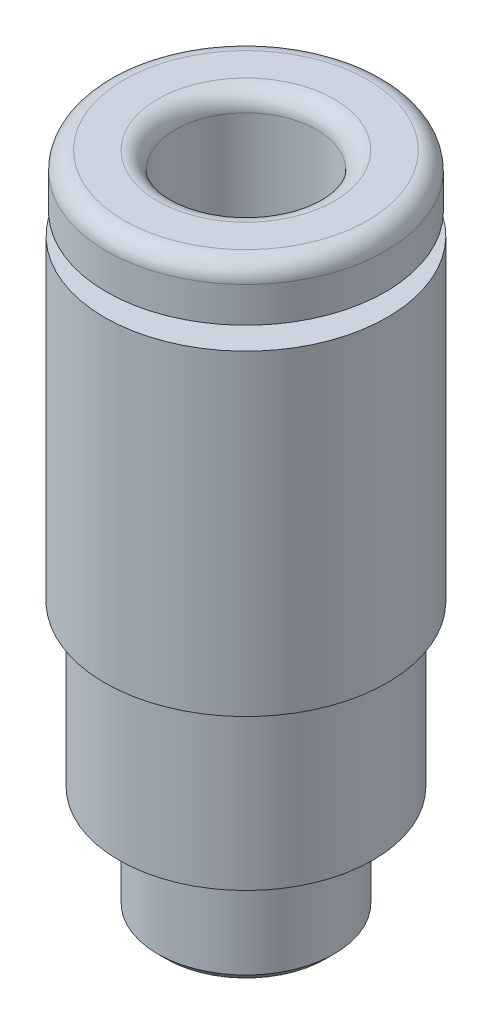
ISO-10303-21;
HEADER;
FILE_DESCRIPTION(('STEP AP214'),'2;1');
FILE_NAME('part.step','',(''),(''),'','','');
FILE_SCHEMA(('AUTOMOTIVE_DESIGN { 1 0 10303 214 1 1 1 1 }'));
ENDSEC;
DATA;
#1=APPLICATION_CONTEXT('core data for automotive mechanical design processes');
#2=APPLICATION_PROTOCOL_DEFINITION('international standard','automotive_design',2000,#1);
#3=PRODUCT_CONTEXT('',#1,'mechanical');
#4=PRODUCT('Part','Part','',(#3));
#5=PRODUCT_RELATED_PRODUCT_CATEGORY('part','',(#4));
#6=PRODUCT_DEFINITION_FORMATION('','',#4);
#7=PRODUCT_DEFINITION_CONTEXT('part definition',#1,'design');
#8=PRODUCT_DEFINITION('design','',#6,#7);
#9=PRODUCT_DEFINITION_SHAPE('','',#8);
#10=(LENGTH_UNIT() NAMED_UNIT(*) SI_UNIT(.MILLI.,.METRE.));
#11=(NAMED_UNIT(*) PLANE_ANGLE_UNIT() SI_UNIT($,.RADIAN.));
#12=(NAMED_UNIT(*) SI_UNIT($,.STERADIAN.) SOLID_ANGLE_UNIT());
#13=UNCERTAINTY_MEASURE_WITH_UNIT(LENGTH_MEASURE(1.E-05),#10,'distance_accuracy_value','');
#14=(GEOMETRIC_REPRESENTATION_CONTEXT(3) GLOBAL_UNCERTAINTY_ASSIGNED_CONTEXT((#13)) GLOBAL_UNIT_ASSIGNED_CONTEXT((#10,
#11,#12)) REPRESENTATION_CONTEXT('',''));
#15=CARTESIAN_POINT('',(0.,0.,0.));
#16=DIRECTION('',(0.,0.,1.));
#17=DIRECTION('',(1.,0.,0.));
#18=AXIS2_PLACEMENT_3D('',#15,#16,#17);
#19=CARTESIAN_POINT('',(-0.721687836487033,-12.7,1.25));
#20=DIRECTION('',(0.,-0.0348994967025011,0.999390827019096));
#21=DIRECTION('',(0.,-0.999390827019096,-0.0348994967025011));
#22=AXIS2_PLACEMENT_3D('',#19,#20,#21);
#23=PLANE('',#22);
#24=DIRECTION('',(-0.0201451448507203,-0.999188016619382,-0.0348924144072821));
#25=VECTOR('',#24,1.);
#26=CARTESIAN_POINT('',(0.721687836487033,-12.7,1.25));
#27=LINE('',#26,#25);
#28=CARTESIAN_POINT('',(0.721687836487033,-12.7,1.25));
#29=VERTEX_POINT('',#28);
#30=CARTESIAN_POINT('',(0.681364805154294,-14.7,1.1801584610165));
#31=VERTEX_POINT('',#30);
#32=EDGE_CURVE('E193',#29,#31,#27,.T.);
#33=ORIENTED_EDGE('',*,*,#32,.T.);
#34=DIRECTION('',(1.,0.,0.));
#35=VECTOR('',#34,1.);
#36=CARTESIAN_POINT('',(-0.721687836487033,-14.7,1.1801584610165));
#37=LINE('',#36,#35);
#38=CARTESIAN_POINT('',(0.,-14.7,1.1801584610165));
#39=VERTEX_POINT('',#38);
#40=EDGE_CURVE('E194',#39,#31,#37,.T.);
#41=ORIENTED_EDGE('',*,*,#40,.F.);
#42=DIRECTION('',(1.,0.,0.));
#43=VECTOR('',#42,1.);
#44=CARTESIAN_POINT('',(-0.721687836487033,-14.7,1.1801584610165));
#45=LINE('',#44,#43);
#46=CARTESIAN_POINT('',(-0.681364805154294,-14.7,1.1801584610165));
#47=VERTEX_POINT('',#46);
#48=EDGE_CURVE('E197',#47,#39,#45,.T.);
#49=ORIENTED_EDGE('',*,*,#48,.F.);
#50=DIRECTION('',(-0.0201451448507203,0.999188016619382,0.034892414407282));
#51=VECTOR('',#50,1.);
#52=CARTESIAN_POINT('',(-0.681364805154294,-14.7,1.1801584610165));
#53=LINE('',#52,#51);
#54=CARTESIAN_POINT('',(-0.721687836487033,-12.7,1.25));
#55=VERTEX_POINT('',#54);
#56=EDGE_CURVE('E185',#47,#55,#53,.T.);
#57=ORIENTED_EDGE('',*,*,#56,.T.);
#58=DIRECTION('',(1.,0.,0.));
#59=VECTOR('',#58,1.);
#60=CARTESIAN_POINT('',(-0.721687836487033,-12.7,1.25));
#61=LINE('',#60,#59);
#62=EDGE_CURVE('E191',#29,#55,#61,.F.);
#63=ORIENTED_EDGE('',*,*,#62,.F.);
#64=EDGE_LOOP('',(#33,#41,#49,#57,#63));
#65=FACE_BOUND('',#64,.T.);
#66=ADVANCED_FACE('F16',(#65),#23,.F.);
#67=CARTESIAN_POINT('',(0.721687836487033,-12.7,1.25));
#68=DIRECTION('',(0.865497844507677,-0.0348994967025011,0.499695413509547));
#69=DIRECTION('',(0.5,0.,-0.866025403784439));
#70=AXIS2_PLACEMENT_3D('',#67,#68,#69);
#71=PLANE('',#70);
#72=DIRECTION('',(-0.0402902897014406,-0.999188016619382,0.));
#73=VECTOR('',#72,1.);
#74=CARTESIAN_POINT('',(1.44337567297406,-12.7,0.));
#75=LINE('',#74,#73);
#76=CARTESIAN_POINT('',(1.44337567297406,-12.7,0.));
#77=VERTEX_POINT('',#76);
#78=CARTESIAN_POINT('',(1.36272961030859,-14.7,0.));
#79=VERTEX_POINT('',#78);
#80=EDGE_CURVE('E152',#77,#79,#75,.T.);
#81=ORIENTED_EDGE('',*,*,#80,.T.);
#82=DIRECTION('',(0.5,0.,-0.866025403784439));
#83=VECTOR('',#82,1.);
#84=CARTESIAN_POINT('',(0.661203289487925,-14.7,1.21507923050825));
#85=LINE('',#84,#83);
#86=CARTESIAN_POINT('',(1.02204720773144,-14.7,0.590079230508252));
#87=VERTEX_POINT('',#86);
#88=EDGE_CURVE('E169',#87,#79,#85,.T.);
#89=ORIENTED_EDGE('',*,*,#88,.F.);
#90=DIRECTION('',(0.5,0.,-0.866025403784439));
#91=VECTOR('',#90,1.);
#92=CARTESIAN_POINT('',(0.661203289487925,-14.7,1.21507923050825));
#93=LINE('',#92,#91);
#94=EDGE_CURVE('E171',#31,#87,#93,.T.);
#95=ORIENTED_EDGE('',*,*,#94,.F.);
#96=ORIENTED_EDGE('',*,*,#32,.F.);
#97=DIRECTION('',(0.5,0.,-0.866025403784439));
#98=VECTOR('',#97,1.);
#99=CARTESIAN_POINT('',(0.721687836487033,-12.7,1.25));
#100=LINE('',#99,#98);
#101=EDGE_CURVE('E109',#77,#29,#100,.F.);
#102=ORIENTED_EDGE('',*,*,#101,.F.);
#103=EDGE_LOOP('',(#81,#89,#95,#96,#102));
#104=FACE_BOUND('',#103,.T.);
#105=ADVANCED_FACE('F400',(#104),#71,.F.);
#106=CARTESIAN_POINT('',(0.721687836487032,-12.7,-1.25));
#107=DIRECTION('',(0.,-0.0348994967025011,-0.999390827019096));
#108=DIRECTION('',(0.,0.999390827019096,-0.0348994967025011));
#109=AXIS2_PLACEMENT_3D('',#106,#107,#108);
#110=PLANE('',#109);
#111=DIRECTION('',(0.0201451448507203,-0.999188016619382,0.0348924144072821));
#112=VECTOR('',#111,1.);
#113=CARTESIAN_POINT('',(-0.721687836487033,-12.7,-1.25));
#114=LINE('',#113,#112);
#115=CARTESIAN_POINT('',(-0.721687836487033,-12.7,-1.25));
#116=VERTEX_POINT('',#115);
#117=CARTESIAN_POINT('',(-0.681364805154294,-14.7,-1.1801584610165));
#118=VERTEX_POINT('',#117);
#119=EDGE_CURVE('E136',#116,#118,#114,.T.);
#120=ORIENTED_EDGE('',*,*,#119,.T.);
#121=DIRECTION('',(1.,0.,0.));
#122=VECTOR('',#121,1.);
#123=CARTESIAN_POINT('',(0.721687836487032,-14.7,-1.1801584610165));
#124=LINE('',#123,#122);
#125=CARTESIAN_POINT('',(0.,-14.7,-1.1801584610165));
#126=VERTEX_POINT('',#125);
#127=EDGE_CURVE('E108',#126,#118,#124,.F.);
#128=ORIENTED_EDGE('',*,*,#127,.F.);
#129=DIRECTION('',(1.,0.,0.));
#130=VECTOR('',#129,1.);
#131=CARTESIAN_POINT('',(0.721687836487032,-14.7,-1.1801584610165));
#132=LINE('',#131,#130);
#133=CARTESIAN_POINT('',(0.681364805154293,-14.7,-1.1801584610165));
#134=VERTEX_POINT('',#133);
#135=EDGE_CURVE('E98',#134,#126,#132,.F.);
#136=ORIENTED_EDGE('',*,*,#135,.F.);
#137=DIRECTION('',(0.0201451448507203,0.999188016619382,-0.034892414407282));
#138=VECTOR('',#137,1.);
#139=CARTESIAN_POINT('',(0.681364805154293,-14.7,-1.1801584610165));
#140=LINE('',#139,#138);
#141=CARTESIAN_POINT('',(0.721687836487032,-12.7,-1.25));
#142=VERTEX_POINT('',#141);
#143=EDGE_CURVE('E156',#134,#142,#140,.T.);
#144=ORIENTED_EDGE('',*,*,#143,.T.);
#145=DIRECTION('',(1.,0.,0.));
#146=VECTOR('',#145,1.);
#147=CARTESIAN_POINT('',(0.721687836487032,-12.7,-1.25));
#148=LINE('',#147,#146);
#149=EDGE_CURVE('E137',#116,#142,#148,.T.);
#150=ORIENTED_EDGE('',*,*,#149,.F.);
#151=EDGE_LOOP('',(#120,#128,#136,#144,#150));
#152=FACE_BOUND('',#151,.T.);
#153=ADVANCED_FACE('F134',(#152),#110,.F.);
#154=CARTESIAN_POINT('',(-1.44337567297406,-12.7,0.));
#155=DIRECTION('',(-0.865497844507677,-0.034899496702501,0.499695413509548));
#156=DIRECTION('',(0.5,0.,0.866025403784439));
#157=AXIS2_PLACEMENT_3D('',#154,#155,#156);
#158=PLANE('',#157);
#159=ORIENTED_EDGE('',*,*,#56,.F.);
#160=DIRECTION('',(0.5,0.,0.866025403784439));
#161=VECTOR('',#160,1.);
#162=CARTESIAN_POINT('',(-1.38289112597496,-14.7,-0.0349207694917476));
#163=LINE('',#162,#161);
#164=CARTESIAN_POINT('',(-1.02204720773144,-14.7,0.590079230508252));
#165=VERTEX_POINT('',#164);
#166=EDGE_CURVE('E188',#165,#47,#163,.T.);
#167=ORIENTED_EDGE('',*,*,#166,.F.);
#168=DIRECTION('',(0.5,0.,0.866025403784439));
#169=VECTOR('',#168,1.);
#170=CARTESIAN_POINT('',(-1.38289112597496,-14.7,-0.0349207694917476));
#171=LINE('',#170,#169);
#172=CARTESIAN_POINT('',(-1.36272961030859,-14.7,0.));
#173=VERTEX_POINT('',#172);
#174=EDGE_CURVE('E139',#173,#165,#171,.T.);
#175=ORIENTED_EDGE('',*,*,#174,.F.);
#176=DIRECTION('',(-0.0402902897014405,0.999188016619382,0.));
#177=VECTOR('',#176,1.);
#178=CARTESIAN_POINT('',(-1.36272961030859,-14.7,0.));
#179=LINE('',#178,#177);
#180=CARTESIAN_POINT('',(-1.44337567297406,-12.7,0.));
#181=VERTEX_POINT('',#180);
#182=EDGE_CURVE('E359',#173,#181,#179,.T.);
#183=ORIENTED_EDGE('',*,*,#182,.T.);
#184=DIRECTION('',(0.5,0.,0.866025403784439));
#185=VECTOR('',#184,1.);
#186=CARTESIAN_POINT('',(-1.44337567297406,-12.7,0.));
#187=LINE('',#186,#185);
#188=EDGE_CURVE('E166',#55,#181,#187,.F.);
#189=ORIENTED_EDGE('',*,*,#188,.F.);
#190=EDGE_LOOP('',(#159,#167,#175,#183,#189));
#191=FACE_BOUND('',#190,.T.);
#192=ADVANCED_FACE('F388',(#191),#158,.F.);
#193=CARTESIAN_POINT('',(1.44337567297406,-12.7,0.));
#194=DIRECTION('',(0.865497844507676,-0.034899496702501,-0.499695413509548));
#195=DIRECTION('',(-0.5,0.,-0.866025403784438));
#196=AXIS2_PLACEMENT_3D('',#193,#194,#195);
#197=PLANE('',#196);
#198=ORIENTED_EDGE('',*,*,#143,.F.);
#199=DIRECTION('',(-0.5,0.,-0.866025403784438));
#200=VECTOR('',#199,1.);
#201=CARTESIAN_POINT('',(1.38289112597496,-14.7,0.0349207694917474));
#202=LINE('',#201,#200);
#203=CARTESIAN_POINT('',(1.02204720773144,-14.7,-0.590079230508253));
#204=VERTEX_POINT('',#203);
#205=EDGE_CURVE('E103',#204,#134,#202,.T.);
#206=ORIENTED_EDGE('',*,*,#205,.F.);
#207=DIRECTION('',(-0.5,0.,-0.866025403784438));
#208=VECTOR('',#207,1.);
#209=CARTESIAN_POINT('',(1.38289112597496,-14.7,0.0349207694917474));
#210=LINE('',#209,#208);
#211=EDGE_CURVE('E149',#79,#204,#210,.T.);
#212=ORIENTED_EDGE('',*,*,#211,.F.);
#213=ORIENTED_EDGE('',*,*,#80,.F.);
#214=DIRECTION('',(0.5,0.,0.866025403784439));
#215=VECTOR('',#214,1.);
#216=CARTESIAN_POINT('',(0.721687836487032,-12.7,-1.25));
#217=LINE('',#216,#215);
#218=EDGE_CURVE('E178',#142,#77,#217,.T.);
#219=ORIENTED_EDGE('',*,*,#218,.F.);
#220=EDGE_LOOP('',(#198,#206,#212,#213,#219));
#221=FACE_BOUND('',#220,.T.);
#222=ADVANCED_FACE('F404',(#221),#197,.F.);
#223=CARTESIAN_POINT('',(-0.721687836487033,-12.7,-1.25));
#224=DIRECTION('',(-0.865497844507677,-0.034899496702501,-0.499695413509548));
#225=DIRECTION('',(-0.5,0.,0.866025403784439));
#226=AXIS2_PLACEMENT_3D('',#223,#224,#225);
#227=PLANE('',#226);
#228=ORIENTED_EDGE('',*,*,#182,.F.);
#229=DIRECTION('',(0.5,0.,-0.866025403784439));
#230=VECTOR('',#229,1.);
#231=CARTESIAN_POINT('',(-1.36272961030859,-14.7,0.));
#232=LINE('',#231,#230);
#233=CARTESIAN_POINT('',(-1.02204720773144,-14.7,-0.590079230508252));
#234=VERTEX_POINT('',#233);
#235=EDGE_CURVE('E181',#173,#234,#232,.T.);
#236=ORIENTED_EDGE('',*,*,#235,.T.);
#237=DIRECTION('',(0.5,0.,-0.866025403784439));
#238=VECTOR('',#237,1.);
#239=CARTESIAN_POINT('',(-1.02204720773144,-14.7,-0.590079230508252));
#240=LINE('',#239,#238);
#241=EDGE_CURVE('E130',#234,#118,#240,.T.);
#242=ORIENTED_EDGE('',*,*,#241,.T.);
#243=ORIENTED_EDGE('',*,*,#119,.F.);
#244=DIRECTION('',(0.5,0.,-0.866025403784439));
#245=VECTOR('',#244,1.);
#246=CARTESIAN_POINT('',(-1.44337567297406,-12.7,0.));
#247=LINE('',#246,#245);
#248=EDGE_CURVE('E182',#181,#116,#247,.T.);
#249=ORIENTED_EDGE('',*,*,#248,.F.);
#250=EDGE_LOOP('',(#228,#236,#242,#243,#249));
#251=FACE_BOUND('',#250,.T.);
#252=ADVANCED_FACE('F378',(#251),#227,.F.);
#253=CARTESIAN_POINT('',(0.,-12.7,0.));
#254=DIRECTION('',(0.,1.,0.));
#255=DIRECTION('',(0.,0.,1.));
#256=AXIS2_PLACEMENT_3D('',#253,#254,#255);
#257=PLANE('',#256);
#258=CARTESIAN_POINT('',(0.,-12.7,0.));
#259=DIRECTION('',(0.,1.,0.));
#260=DIRECTION('',(0.,0.,1.));
#261=AXIS2_PLACEMENT_3D('',#258,#259,#260);
#262=CIRCLE('',#261,2.);
#263=CARTESIAN_POINT('',(0.,-12.7,2.));
#264=VERTEX_POINT('',#263);
#265=EDGE_CURVE('E123',#264,#264,#262,.T.);
#266=ORIENTED_EDGE('',*,*,#265,.T.);
#267=EDGE_LOOP('',(#266));
#268=FACE_BOUND('',#267,.T.);
#269=ORIENTED_EDGE('',*,*,#149,.T.);
#270=ORIENTED_EDGE('',*,*,#218,.T.);
#271=ORIENTED_EDGE('',*,*,#101,.T.);
#272=ORIENTED_EDGE('',*,*,#62,.T.);
#273=ORIENTED_EDGE('',*,*,#188,.T.);
#274=ORIENTED_EDGE('',*,*,#248,.T.);
#275=EDGE_LOOP('',(#269,#270,#271,#272,#273,#274));
#276=FACE_BOUND('',#275,.T.);
#277=ADVANCED_FACE('F374',(#268,#276),#257,.T.);
#278=CARTESIAN_POINT('',(0.721687836487033,-14.7,1.25));
#279=DIRECTION('',(0.,-1.,0.));
#280=DIRECTION('',(0.,0.,-1.));
#281=AXIS2_PLACEMENT_3D('',#278,#279,#280);
#282=PLANE('',#281);
#283=CARTESIAN_POINT('',(0.,-14.7,0.));
#284=DIRECTION('',(0.,1.,0.));
#285=DIRECTION('',(0.,0.,1.));
#286=AXIS2_PLACEMENT_3D('',#283,#284,#285);
#287=CIRCLE('',#286,1.1801584610165);
#288=EDGE_CURVE('E101',#126,#204,#287,.F.);
#289=ORIENTED_EDGE('',*,*,#288,.T.);
#290=ORIENTED_EDGE('',*,*,#205,.T.);
#291=ORIENTED_EDGE('',*,*,#135,.T.);
#292=EDGE_LOOP('',(#289,#290,#291));
#293=FACE_BOUND('',#292,.T.);
#294=ADVANCED_FACE('F100',(#293),#282,.F.);
#295=CARTESIAN_POINT('',(0.721687836487033,-14.7,1.25));
#296=DIRECTION('',(0.,-1.,0.));
#297=DIRECTION('',(0.,0.,-1.));
#298=AXIS2_PLACEMENT_3D('',#295,#296,#297);
#299=PLANE('',#298);
#300=CARTESIAN_POINT('',(0.,-14.7,0.));
#301=DIRECTION('',(0.,1.,0.));
#302=DIRECTION('',(0.,0.,1.));
#303=AXIS2_PLACEMENT_3D('',#300,#301,#302);
#304=CIRCLE('',#303,1.1801584610165);
#305=EDGE_CURVE('E122',#204,#87,#304,.F.);
#306=ORIENTED_EDGE('',*,*,#305,.T.);
#307=ORIENTED_EDGE('',*,*,#88,.T.);
#308=ORIENTED_EDGE('',*,*,#211,.T.);
#309=EDGE_LOOP('',(#306,#307,#308));
#310=FACE_BOUND('',#309,.T.);
#311=ADVANCED_FACE('F397',(#310),#299,.F.);
#312=CARTESIAN_POINT('',(0.721687836487033,-14.7,1.25));
#313=DIRECTION('',(0.,-1.,0.));
#314=DIRECTION('',(0.,0.,-1.));
#315=AXIS2_PLACEMENT_3D('',#312,#313,#314);
#316=PLANE('',#315);
#317=CARTESIAN_POINT('',(0.,-14.7,0.));
#318=DIRECTION('',(0.,1.,0.));
#319=DIRECTION('',(0.,0.,1.));
#320=AXIS2_PLACEMENT_3D('',#317,#318,#319);
#321=CIRCLE('',#320,1.1801584610165);
#322=EDGE_CURVE('E244',#87,#39,#321,.F.);
#323=ORIENTED_EDGE('',*,*,#322,.T.);
#324=ORIENTED_EDGE('',*,*,#40,.T.);
#325=ORIENTED_EDGE('',*,*,#94,.T.);
#326=EDGE_LOOP('',(#323,#324,#325));
#327=FACE_BOUND('',#326,.T.);
#328=ADVANCED_FACE('F394',(#327),#316,.F.);
#329=CARTESIAN_POINT('',(0.721687836487033,-14.7,1.25));
#330=DIRECTION('',(0.,-1.,0.));
#331=DIRECTION('',(0.,0.,-1.));
#332=AXIS2_PLACEMENT_3D('',#329,#330,#331);
#333=PLANE('',#332);
#334=CARTESIAN_POINT('',(0.,-14.7,0.));
#335=DIRECTION('',(0.,1.,0.));
#336=DIRECTION('',(0.,0.,1.));
#337=AXIS2_PLACEMENT_3D('',#334,#335,#336);
#338=CIRCLE('',#337,1.1801584610165);
#339=EDGE_CURVE('E241',#39,#165,#338,.F.);
#340=ORIENTED_EDGE('',*,*,#339,.T.);
#341=ORIENTED_EDGE('',*,*,#166,.T.);
#342=ORIENTED_EDGE('',*,*,#48,.T.);
#343=EDGE_LOOP('',(#340,#341,#342));
#344=FACE_BOUND('',#343,.T.);
#345=ADVANCED_FACE('F384',(#344),#333,.F.);
#346=CARTESIAN_POINT('',(0.721687836487033,-14.7,1.25));
#347=DIRECTION('',(0.,-1.,0.));
#348=DIRECTION('',(0.,0.,-1.));
#349=AXIS2_PLACEMENT_3D('',#346,#347,#348);
#350=PLANE('',#349);
#351=CARTESIAN_POINT('',(0.,-14.7,0.));
#352=DIRECTION('',(0.,1.,0.));
#353=DIRECTION('',(0.,0.,1.));
#354=AXIS2_PLACEMENT_3D('',#351,#352,#353);
#355=CIRCLE('',#354,1.1801584610165);
#356=EDGE_CURVE('E132',#165,#234,#355,.F.);
#357=ORIENTED_EDGE('',*,*,#356,.T.);
#358=ORIENTED_EDGE('',*,*,#235,.F.);
#359=ORIENTED_EDGE('',*,*,#174,.T.);
#360=EDGE_LOOP('',(#357,#358,#359));
#361=FACE_BOUND('',#360,.T.);
#362=ADVANCED_FACE('F381',(#361),#350,.F.);
#363=CARTESIAN_POINT('',(0.721687836487033,-14.7,1.25));
#364=DIRECTION('',(0.,-1.,0.));
#365=DIRECTION('',(0.,0.,-1.));
#366=AXIS2_PLACEMENT_3D('',#363,#364,#365);
#367=PLANE('',#366);
#368=CARTESIAN_POINT('',(0.,-14.7,0.));
#369=DIRECTION('',(0.,1.,0.));
#370=DIRECTION('',(0.,0.,1.));
#371=AXIS2_PLACEMENT_3D('',#368,#369,#370);
#372=CIRCLE('',#371,1.1801584610165);
#373=EDGE_CURVE('E119',#234,#126,#372,.F.);
#374=ORIENTED_EDGE('',*,*,#373,.T.);
#375=ORIENTED_EDGE('',*,*,#127,.T.);
#376=ORIENTED_EDGE('',*,*,#241,.F.);
#377=EDGE_LOOP('',(#374,#375,#376));
#378=FACE_BOUND('',#377,.T.);
#379=ADVANCED_FACE('F127',(#378),#367,.F.);
#380=CARTESIAN_POINT('',(0.,-18.3568542494924,0.));
#381=DIRECTION('',(0.,1.,0.));
#382=DIRECTION('',(0.,0.,1.));
#383=AXIS2_PLACEMENT_3D('',#380,#381,#382);
#384=CYLINDRICAL_SURFACE('',#383,2.);
#385=ORIENTED_EDGE('',*,*,#265,.F.);
#386=EDGE_LOOP('',(#385));
#387=FACE_BOUND('',#386,.T.);
#388=CARTESIAN_POINT('',(0.,-0.500000000000001,0.));
#389=DIRECTION('',(0.,1.,0.));
#390=DIRECTION('',(0.,0.,1.));
#391=AXIS2_PLACEMENT_3D('',#388,#389,#390);
#392=CIRCLE('',#391,2.);
#393=CARTESIAN_POINT('',(0.,-0.500000000000001,2.));
#394=VERTEX_POINT('',#393);
#395=EDGE_CURVE('E131',#394,#394,#392,.F.);
#396=ORIENTED_EDGE('',*,*,#395,.F.);
#397=EDGE_LOOP('',(#396));
#398=FACE_BOUND('',#397,.T.);
#399=ADVANCED_FACE('F475',(#387,#398),#384,.F.);
#400=CARTESIAN_POINT('',(0.,-18.7,0.));
#401=DIRECTION('',(0.,1.,0.));
#402=DIRECTION('',(0.,0.,1.));
#403=AXIS2_PLACEMENT_3D('',#400,#401,#402);
#404=CYLINDRICAL_SURFACE('',#403,1.1801584610165);
#405=ORIENTED_EDGE('',*,*,#339,.F.);
#406=ORIENTED_EDGE('',*,*,#322,.F.);
#407=ORIENTED_EDGE('',*,*,#305,.F.);
#408=ORIENTED_EDGE('',*,*,#288,.F.);
#409=ORIENTED_EDGE('',*,*,#373,.F.);
#410=ORIENTED_EDGE('',*,*,#356,.F.);
#411=EDGE_LOOP('',(#405,#406,#407,#408,#409,#410));
#412=FACE_BOUND('',#411,.T.);
#413=CARTESIAN_POINT('',(0.,-18.7,0.));
#414=DIRECTION('',(0.,1.,0.));
#415=DIRECTION('',(0.,0.,1.));
#416=AXIS2_PLACEMENT_3D('',#413,#414,#415);
#417=CIRCLE('',#416,1.1801584610165);
#418=CARTESIAN_POINT('',(0.,-18.7,1.1801584610165));
#419=VERTEX_POINT('',#418);
#420=EDGE_CURVE('E235',#419,#419,#417,.T.);
#421=ORIENTED_EDGE('',*,*,#420,.F.);
#422=EDGE_LOOP('',(#421));
#423=FACE_BOUND('',#422,.T.);
#424=ADVANCED_FACE('F116',(#412,#423),#404,.F.);
#425=CARTESIAN_POINT('',(0.,-0.5,0.));
#426=DIRECTION('',(0.,1.,0.));
#427=DIRECTION('',(0.,0.,1.));
#428=AXIS2_PLACEMENT_3D('',#425,#426,#427);
#429=TOROIDAL_SURFACE('',#428,2.5,0.5);
#430=ORIENTED_EDGE('',*,*,#395,.T.);
#431=EDGE_LOOP('',(#430));
#432=FACE_BOUND('',#431,.T.);
#433=CARTESIAN_POINT('',(0.,0.,0.));
#434=DIRECTION('',(0.,1.,0.));
#435=DIRECTION('',(0.,0.,1.));
#436=AXIS2_PLACEMENT_3D('',#433,#434,#435);
#437=CIRCLE('',#436,2.5);
#438=CARTESIAN_POINT('',(0.,0.,-2.5));
#439=VERTEX_POINT('',#438);
#440=CARTESIAN_POINT('',(0.,0.,2.5));
#441=VERTEX_POINT('',#440);
#442=EDGE_CURVE('E234',#439,#441,#437,.F.);
#443=ORIENTED_EDGE('',*,*,#442,.F.);
#444=CARTESIAN_POINT('',(0.,0.,0.));
#445=DIRECTION('',(0.,1.,0.));
#446=DIRECTION('',(0.,0.,-1.));
#447=AXIS2_PLACEMENT_3D('',#444,#445,#446);
#448=CIRCLE('',#447,2.5);
#449=EDGE_CURVE('E237',#441,#439,#448,.F.);
#450=ORIENTED_EDGE('',*,*,#449,.F.);
#451=EDGE_LOOP('',(#443,#450));
#452=FACE_BOUND('',#451,.T.);
#453=ADVANCED_FACE('F335',(#432,#452),#429,.T.);
#454=CARTESIAN_POINT('',(-2.49999999999998,-18.7,0.));
#455=DIRECTION('',(0.,-1.,0.));
#456=DIRECTION('',(0.,0.,-1.));
#457=AXIS2_PLACEMENT_3D('',#454,#455,#456);
#458=PLANE('',#457);
#459=CARTESIAN_POINT('',(0.,-18.6999999999102,0.));
#460=DIRECTION('',(0.,1.,0.));
#461=DIRECTION('',(0.,0.,1.));
#462=AXIS2_PLACEMENT_3D('',#459,#460,#461);
#463=CIRCLE('',#462,2.24999999994679);
#464=CARTESIAN_POINT('',(0.,-18.6999999999102,2.24999999994679));
#465=VERTEX_POINT('',#464);
#466=EDGE_CURVE('E231',#465,#465,#463,.T.);
#467=ORIENTED_EDGE('',*,*,#466,.F.);
#468=EDGE_LOOP('',(#467));
#469=FACE_BOUND('',#468,.T.);
#470=ORIENTED_EDGE('',*,*,#420,.T.);
#471=EDGE_LOOP('',(#470));
#472=FACE_BOUND('',#471,.T.);
#473=ADVANCED_FACE('F298',(#469,#472),#458,.T.);
#474=CARTESIAN_POINT('',(0.,0.,0.));
#475=DIRECTION('',(0.,1.,0.));
#476=DIRECTION('',(0.,0.,1.));
#477=AXIS2_PLACEMENT_3D('',#474,#475,#476);
#478=PLANE('',#477);
#479=CARTESIAN_POINT('',(0.,0.,0.));
#480=DIRECTION('',(0.,-1.,0.));
#481=DIRECTION('',(0.,0.,-1.));
#482=AXIS2_PLACEMENT_3D('',#479,#480,#481);
#483=CIRCLE('',#482,3.45);
#484=CARTESIAN_POINT('',(0.,0.,-3.45));
#485=VERTEX_POINT('',#484);
#486=CARTESIAN_POINT('',(0.,0.,3.45));
#487=VERTEX_POINT('',#486);
#488=EDGE_CURVE('E35',#485,#487,#483,.T.);
#489=ORIENTED_EDGE('',*,*,#488,.F.);
#490=CARTESIAN_POINT('',(0.,0.,0.));
#491=DIRECTION('',(0.,-1.,0.));
#492=DIRECTION('',(0.,0.,1.));
#493=AXIS2_PLACEMENT_3D('',#490,#491,#492);
#494=CIRCLE('',#493,3.45);
#495=EDGE_CURVE('E280',#487,#485,#494,.T.);
#496=ORIENTED_EDGE('',*,*,#495,.F.);
#497=EDGE_LOOP('',(#489,#496));
#498=FACE_BOUND('',#497,.T.);
#499=ORIENTED_EDGE('',*,*,#449,.T.);
#500=ORIENTED_EDGE('',*,*,#442,.T.);
#501=EDGE_LOOP('',(#499,#500));
#502=FACE_BOUND('',#501,.T.);
#503=ADVANCED_FACE('F289',(#498,#502),#478,.T.);
#504=CARTESIAN_POINT('',(0.,-18.449999999973,0.));
#505=DIRECTION('',(0.,1.,0.));
#506=DIRECTION('',(0.,0.,1.));
#507=AXIS2_PLACEMENT_3D('',#504,#505,#506);
#508=CONICAL_SURFACE('',#507,2.49999999988404,0.785398163397448);
#509=CARTESIAN_POINT('',(0.,-18.45,0.));
#510=DIRECTION('',(0.,1.,0.));
#511=DIRECTION('',(0.,0.,1.));
#512=AXIS2_PLACEMENT_3D('',#509,#510,#511);
#513=CIRCLE('',#512,2.49999999999999);
#514=CARTESIAN_POINT('',(0.,-18.45,2.49999999999999));
#515=VERTEX_POINT('',#514);
#516=EDGE_CURVE('E277',#515,#515,#513,.T.);
#517=ORIENTED_EDGE('',*,*,#516,.F.);
#518=EDGE_LOOP('',(#517));
#519=FACE_BOUND('',#518,.T.);
#520=ORIENTED_EDGE('',*,*,#466,.T.);
#521=EDGE_LOOP('',(#520));
#522=FACE_BOUND('',#521,.T.);
#523=ADVANCED_FACE('F265',(#519,#522),#508,.T.);
#524=CARTESIAN_POINT('',(0.,-0.5,0.));
#525=DIRECTION('',(0.,1.,0.));
#526=DIRECTION('',(0.,0.,1.));
#527=AXIS2_PLACEMENT_3D('',#524,#525,#526);
#528=TOROIDAL_SURFACE('',#527,3.45,0.5);
#529=CARTESIAN_POINT('',(0.,-0.5,0.));
#530=DIRECTION('',(0.,1.,0.));
#531=DIRECTION('',(0.,0.,1.));
#532=AXIS2_PLACEMENT_3D('',#529,#530,#531);
#533=CIRCLE('',#532,3.95);
#534=CARTESIAN_POINT('',(0.,-0.5,3.95));
#535=VERTEX_POINT('',#534);
#536=EDGE_CURVE('E230',#535,#535,#533,.F.);
#537=ORIENTED_EDGE('',*,*,#536,.F.);
#538=EDGE_LOOP('',(#537));
#539=FACE_BOUND('',#538,.T.);
#540=ORIENTED_EDGE('',*,*,#495,.T.);
#541=ORIENTED_EDGE('',*,*,#488,.T.);
#542=EDGE_LOOP('',(#540,#541));
#543=FACE_BOUND('',#542,.T.);
#544=ADVANCED_FACE('F253',(#539,#543),#528,.T.);
#545=CARTESIAN_POINT('',(0.,0.,0.));
#546=DIRECTION('',(0.,1.,0.));
#547=DIRECTION('',(0.,0.,1.));
#548=AXIS2_PLACEMENT_3D('',#545,#546,#547);
#549=CYLINDRICAL_SURFACE('',#548,2.49999999999999);
#550=CARTESIAN_POINT('',(0.,-15.6,0.));
#551=DIRECTION('',(0.,1.,0.));
#552=DIRECTION('',(0.,0.,1.));
#553=AXIS2_PLACEMENT_3D('',#550,#551,#552);
#554=CIRCLE('',#553,2.49999999999999);
#555=CARTESIAN_POINT('',(0.,-15.6,2.49999999999999));
#556=VERTEX_POINT('',#555);
#557=EDGE_CURVE('E227',#556,#556,#554,.F.);
#558=ORIENTED_EDGE('',*,*,#557,.T.);
#559=EDGE_LOOP('',(#558));
#560=FACE_BOUND('',#559,.T.);
#561=ORIENTED_EDGE('',*,*,#516,.T.);
#562=EDGE_LOOP('',(#561));
#563=FACE_BOUND('',#562,.T.);
#564=ADVANCED_FACE('F264',(#560,#563),#549,.T.);
#565=CARTESIAN_POINT('',(0.,0.,0.));
#566=DIRECTION('',(0.,1.,0.));
#567=DIRECTION('',(0.,0.,1.));
#568=AXIS2_PLACEMENT_3D('',#565,#566,#567);
#569=CYLINDRICAL_SURFACE('',#568,3.95);
#570=CARTESIAN_POINT('',(0.,-1.5,0.));
#571=DIRECTION('',(0.,1.,0.));
#572=DIRECTION('',(0.,0.,1.));
#573=AXIS2_PLACEMENT_3D('',#570,#571,#572);
#574=CIRCLE('',#573,3.95);
#575=CARTESIAN_POINT('',(0.,-1.5,3.95));
#576=VERTEX_POINT('',#575);
#577=EDGE_CURVE('E224',#576,#576,#574,.F.);
#578=ORIENTED_EDGE('',*,*,#577,.F.);
#579=EDGE_LOOP('',(#578));
#580=FACE_BOUND('',#579,.T.);
#581=ORIENTED_EDGE('',*,*,#536,.T.);
#582=EDGE_LOOP('',(#581));
#583=FACE_BOUND('',#582,.T.);
#584=ADVANCED_FACE('F445',(#580,#583),#569,.T.);
#585=CARTESIAN_POINT('',(0.,-15.6,0.));
#586=DIRECTION('',(0.,1.,0.));
#587=DIRECTION('',(0.,0.,1.));
#588=AXIS2_PLACEMENT_3D('',#585,#586,#587);
#589=PLANE('',#588);
#590=CARTESIAN_POINT('',(0.,-15.6,0.));
#591=DIRECTION('',(0.,1.,0.));
#592=DIRECTION('',(0.,0.,1.));
#593=AXIS2_PLACEMENT_3D('',#590,#591,#592);
#594=CIRCLE('',#593,3.6);
#595=CARTESIAN_POINT('',(0.,-15.6,3.6));
#596=VERTEX_POINT('',#595);
#597=EDGE_CURVE('E221',#596,#596,#594,.T.);
#598=ORIENTED_EDGE('',*,*,#597,.F.);
#599=EDGE_LOOP('',(#598));
#600=FACE_BOUND('',#599,.T.);
#601=ORIENTED_EDGE('',*,*,#557,.F.);
#602=EDGE_LOOP('',(#601));
#603=FACE_BOUND('',#602,.T.);
#604=ADVANCED_FACE('F442',(#600,#603),#589,.F.);
#605=CARTESIAN_POINT('',(-3.95,-1.5,0.));
#606=DIRECTION('',(0.,-1.,0.));
#607=DIRECTION('',(0.,0.,-1.));
#608=AXIS2_PLACEMENT_3D('',#605,#606,#607);
#609=PLANE('',#608);
#610=ORIENTED_EDGE('',*,*,#577,.T.);
#611=EDGE_LOOP('',(#610));
#612=FACE_BOUND('',#611,.T.);
#613=CARTESIAN_POINT('',(0.,-1.5,0.));
#614=DIRECTION('',(0.,1.,0.));
#615=DIRECTION('',(0.,0.,1.));
#616=AXIS2_PLACEMENT_3D('',#613,#614,#615);
#617=CIRCLE('',#616,2.2);
#618=CARTESIAN_POINT('',(0.,-1.5,2.2));
#619=VERTEX_POINT('',#618);
#620=EDGE_CURVE('E218',#619,#619,#617,.F.);
#621=ORIENTED_EDGE('',*,*,#620,.F.);
#622=EDGE_LOOP('',(#621));
#623=FACE_BOUND('',#622,.T.);
#624=ADVANCED_FACE('F438',(#612,#623),#609,.T.);
#625=CARTESIAN_POINT('',(0.,-25.7823376490863,0.));
#626=DIRECTION('',(0.,1.,0.));
#627=DIRECTION('',(0.,0.,1.));
#628=AXIS2_PLACEMENT_3D('',#625,#626,#627);
#629=CYLINDRICAL_SURFACE('',#628,3.6);
#630=ORIENTED_EDGE('',*,*,#597,.T.);
#631=EDGE_LOOP('',(#630));
#632=FACE_BOUND('',#631,.T.);
#633=CARTESIAN_POINT('',(0.,-11.1999999999739,0.));
#634=DIRECTION('',(0.,1.,0.));
#635=DIRECTION('',(0.,0.,1.));
#636=AXIS2_PLACEMENT_3D('',#633,#634,#635);
#637=CIRCLE('',#636,3.60000000000582);
#638=CARTESIAN_POINT('',(0.,-11.1999999999739,3.60000000000582));
#639=VERTEX_POINT('',#638);
#640=EDGE_CURVE('E217',#639,#639,#637,.T.);
#641=ORIENTED_EDGE('',*,*,#640,.F.);
#642=EDGE_LOOP('',(#641));
#643=FACE_BOUND('',#642,.T.);
#644=ADVANCED_FACE('F434',(#632,#643),#629,.T.);
#645=CARTESIAN_POINT('',(0.,0.,0.));
#646=DIRECTION('',(0.,1.,0.));
#647=DIRECTION('',(0.,0.,1.));
#648=AXIS2_PLACEMENT_3D('',#645,#646,#647);
#649=CYLINDRICAL_SURFACE('',#648,2.2);
#650=ORIENTED_EDGE('',*,*,#620,.T.);
#651=EDGE_LOOP('',(#650));
#652=FACE_BOUND('',#651,.T.);
#653=CARTESIAN_POINT('',(0.,-2.1,0.));
#654=DIRECTION('',(0.,1.,0.));
#655=DIRECTION('',(0.,0.,1.));
#656=AXIS2_PLACEMENT_3D('',#653,#654,#655);
#657=CIRCLE('',#656,2.2);
#658=CARTESIAN_POINT('',(0.,-2.1,2.2));
#659=VERTEX_POINT('',#658);
#660=EDGE_CURVE('E214',#659,#659,#657,.F.);
#661=ORIENTED_EDGE('',*,*,#660,.F.);
#662=EDGE_LOOP('',(#661));
#663=FACE_BOUND('',#662,.T.);
#664=ADVANCED_FACE('F430',(#652,#663),#649,.T.);
#665=CARTESIAN_POINT('',(0.,-11.0544119062865,0.));
#666=DIRECTION('',(0.,1.,0.));
#667=DIRECTION('',(0.,0.,1.));
#668=AXIS2_PLACEMENT_3D('',#665,#666,#667);
#669=CONICAL_SURFACE('',#668,3.99999999996226,1.22173047640323);
#670=ORIENTED_EDGE('',*,*,#640,.T.);
#671=EDGE_LOOP('',(#670));
#672=FACE_BOUND('',#671,.T.);
#673=CARTESIAN_POINT('',(0.,-11.0544119062935,0.));
#674=DIRECTION('',(0.,1.,0.));
#675=DIRECTION('',(0.,0.,1.));
#676=AXIS2_PLACEMENT_3D('',#673,#674,#675);
#677=CIRCLE('',#676,4.);
#678=CARTESIAN_POINT('',(0.,-11.0544119062935,4.));
#679=VERTEX_POINT('',#678);
#680=EDGE_CURVE('E27',#679,#679,#677,.T.);
#681=ORIENTED_EDGE('',*,*,#680,.F.);
#682=EDGE_LOOP('',(#681));
#683=FACE_BOUND('',#682,.T.);
#684=ADVANCED_FACE('F422',(#672,#683),#669,.T.);
#685=CARTESIAN_POINT('',(0.,-2.1,0.));
#686=DIRECTION('',(0.,1.,0.));
#687=DIRECTION('',(0.,0.,1.));
#688=AXIS2_PLACEMENT_3D('',#685,#686,#687);
#689=PLANE('',#688);
#690=CARTESIAN_POINT('',(0.,-2.1,0.));
#691=DIRECTION('',(0.,1.,0.));
#692=DIRECTION('',(0.,0.,1.));
#693=AXIS2_PLACEMENT_3D('',#690,#691,#692);
#694=CIRCLE('',#693,4.);
#695=CARTESIAN_POINT('',(0.,-2.1,4.));
#696=VERTEX_POINT('',#695);
#697=EDGE_CURVE('E10',#696,#696,#694,.F.);
#698=ORIENTED_EDGE('',*,*,#697,.F.);
#699=EDGE_LOOP('',(#698));
#700=FACE_BOUND('',#699,.T.);
#701=ORIENTED_EDGE('',*,*,#660,.T.);
#702=EDGE_LOOP('',(#701));
#703=FACE_BOUND('',#702,.T.);
#704=ADVANCED_FACE('F416',(#700,#703),#689,.T.);
#705=CARTESIAN_POINT('',(0.,-22.5137084989848,0.));
#706=DIRECTION('',(0.,1.,0.));
#707=DIRECTION('',(0.,0.,1.));
#708=AXIS2_PLACEMENT_3D('',#705,#706,#707);
#709=CYLINDRICAL_SURFACE('',#708,4.);
#710=ORIENTED_EDGE('',*,*,#680,.T.);
#711=EDGE_LOOP('',(#710));
#712=FACE_BOUND('',#711,.T.);
#713=ORIENTED_EDGE('',*,*,#697,.T.);
#714=EDGE_LOOP('',(#713));
#715=FACE_BOUND('',#714,.T.);
#716=ADVANCED_FACE('F414',(#712,#715),#709,.T.);
#717=CLOSED_SHELL('',(#66,#105,#153,#192,#222,#252,#277,#294,#311,#328,#345,#362,#379,#399,#424,
#453,#473,#503,#523,#544,#564,#584,#604,#624,#644,#664,#684,#704,#716));
#718=MANIFOLD_SOLID_BREP('B1',#717);
#719=ADVANCED_BREP_SHAPE_REPRESENTATION('',(#18,#718),#14);
#720=SHAPE_DEFINITION_REPRESENTATION(#9,#719);
ENDSEC;
END-ISO-10303-21;
